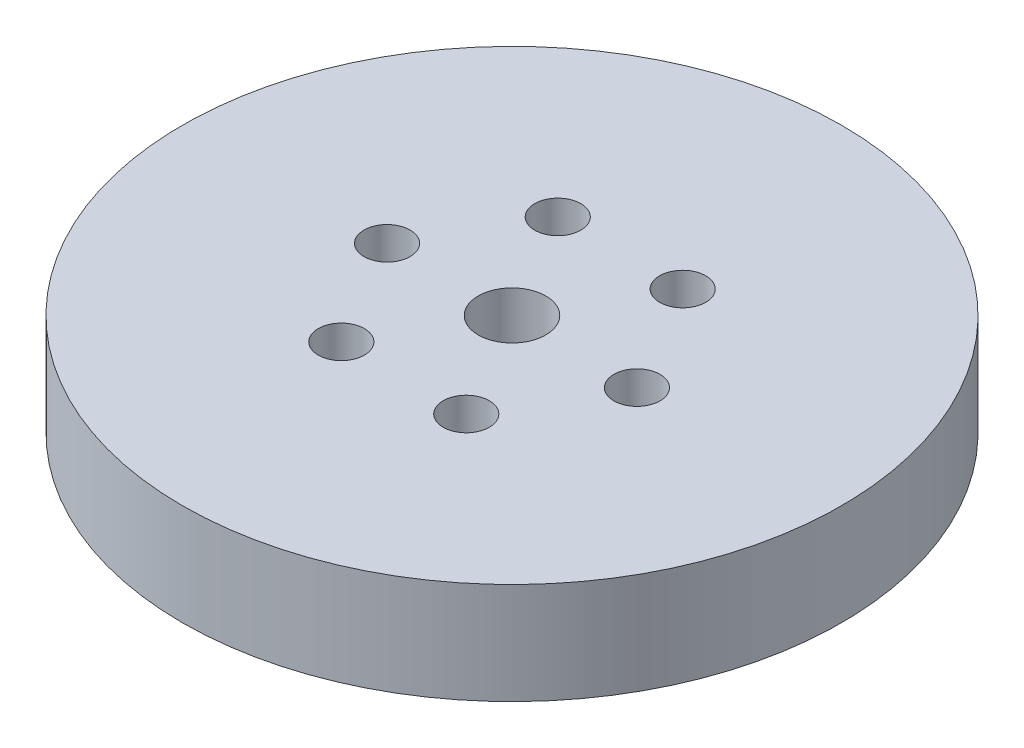
ISO-10303-21;
HEADER;
FILE_DESCRIPTION(('STEP AP214'),'2;1');
FILE_NAME('part.step','',(''),(''),'','','');
FILE_SCHEMA(('AUTOMOTIVE_DESIGN { 1 0 10303 214 1 1 1 1 }'));
ENDSEC;
DATA;
#1=APPLICATION_CONTEXT('core data for automotive mechanical design processes');
#2=APPLICATION_PROTOCOL_DEFINITION('international standard','automotive_design',2000,#1);
#3=PRODUCT_CONTEXT('',#1,'mechanical');
#4=PRODUCT('Part','Part','',(#3));
#5=PRODUCT_RELATED_PRODUCT_CATEGORY('part','',(#4));
#6=PRODUCT_DEFINITION_FORMATION('','',#4);
#7=PRODUCT_DEFINITION_CONTEXT('part definition',#1,'design');
#8=PRODUCT_DEFINITION('design','',#6,#7);
#9=PRODUCT_DEFINITION_SHAPE('','',#8);
#10=(LENGTH_UNIT() NAMED_UNIT(*) SI_UNIT(.MILLI.,.METRE.));
#11=(NAMED_UNIT(*) PLANE_ANGLE_UNIT() SI_UNIT($,.RADIAN.));
#12=(NAMED_UNIT(*) SI_UNIT($,.STERADIAN.) SOLID_ANGLE_UNIT());
#13=UNCERTAINTY_MEASURE_WITH_UNIT(LENGTH_MEASURE(1.E-05),#10,'distance_accuracy_value','');
#14=(GEOMETRIC_REPRESENTATION_CONTEXT(3) GLOBAL_UNCERTAINTY_ASSIGNED_CONTEXT((#13)) GLOBAL_UNIT_ASSIGNED_CONTEXT((#10,
#11,#12)) REPRESENTATION_CONTEXT('',''));
#15=CARTESIAN_POINT('',(0.,0.,0.));
#16=DIRECTION('',(0.,0.,1.));
#17=DIRECTION('',(1.,0.,0.));
#18=AXIS2_PLACEMENT_3D('',#15,#16,#17);
#19=CARTESIAN_POINT('',(0.,30.,0.));
#20=DIRECTION('',(0.,-1.,0.));
#21=DIRECTION('',(0.,0.,-1.));
#22=AXIS2_PLACEMENT_3D('',#19,#20,#21);
#23=CYLINDRICAL_SURFACE('',#22,97.5);
#24=CARTESIAN_POINT('',(0.,30.,0.));
#25=DIRECTION('',(0.,1.,0.));
#26=DIRECTION('',(0.,0.,1.));
#27=AXIS2_PLACEMENT_3D('',#24,#25,#26);
#28=CIRCLE('',#27,97.5);
#29=CARTESIAN_POINT('',(0.,30.,97.5));
#30=VERTEX_POINT('',#29);
#31=EDGE_CURVE('E10',#30,#30,#28,.T.);
#32=ORIENTED_EDGE('',*,*,#31,.F.);
#33=EDGE_LOOP('',(#32));
#34=FACE_BOUND('',#33,.T.);
#35=CARTESIAN_POINT('',(0.,0.,0.));
#36=DIRECTION('',(0.,1.,0.));
#37=DIRECTION('',(0.,0.,1.));
#38=AXIS2_PLACEMENT_3D('',#35,#36,#37);
#39=CIRCLE('',#38,97.5);
#40=CARTESIAN_POINT('',(0.,0.,97.5));
#41=VERTEX_POINT('',#40);
#42=EDGE_CURVE('E37',#41,#41,#39,.T.);
#43=ORIENTED_EDGE('',*,*,#42,.T.);
#44=EDGE_LOOP('',(#43));
#45=FACE_BOUND('',#44,.T.);
#46=ADVANCED_FACE('F40',(#34,#45),#23,.T.);
#47=CARTESIAN_POINT('',(0.,30.,0.));
#48=DIRECTION('',(0.,1.,0.));
#49=DIRECTION('',(0.,0.,1.));
#50=AXIS2_PLACEMENT_3D('',#47,#48,#49);
#51=PLANE('',#50);
#52=CARTESIAN_POINT('',(-18.4839377633088,30.,-32.0151193299911));
#53=DIRECTION('',(0.,1.,0.));
#54=DIRECTION('',(-0.866025403784433,0.,0.50000000000001));
#55=AXIS2_PLACEMENT_3D('',#52,#53,#54);
#56=CIRCLE('',#55,6.8190961265061);
#57=CARTESIAN_POINT('',(-24.3894482397112,30.,-28.605571266738));
#58=VERTEX_POINT('',#57);
#59=EDGE_CURVE('E70',#58,#58,#56,.T.);
#60=ORIENTED_EDGE('',*,*,#59,.F.);
#61=EDGE_LOOP('',(#60));
#62=FACE_BOUND('',#61,.T.);
#63=CARTESIAN_POINT('',(18.4839377633082,30.,-32.0151193299915));
#64=DIRECTION('',(0.,1.,0.));
#65=DIRECTION('',(-0.866025403784443,0.,-0.499999999999992));
#66=AXIS2_PLACEMENT_3D('',#63,#64,#65);
#67=CIRCLE('',#66,6.8190961265061);
#68=CARTESIAN_POINT('',(12.5784272869058,30.,-35.4246673932445));
#69=VERTEX_POINT('',#68);
#70=EDGE_CURVE('E71',#69,#69,#67,.T.);
#71=ORIENTED_EDGE('',*,*,#70,.F.);
#72=EDGE_LOOP('',(#71));
#73=FACE_BOUND('',#72,.T.);
#74=CARTESIAN_POINT('',(36.9678755266169,30.,0.));
#75=DIRECTION('',(0.,1.,0.));
#76=DIRECTION('',(0.,0.,-1.));
#77=AXIS2_PLACEMENT_3D('',#74,#75,#76);
#78=CIRCLE('',#77,6.8190961265061);
#79=CARTESIAN_POINT('',(36.9678755266169,30.,-6.8190961265061));
#80=VERTEX_POINT('',#79);
#81=EDGE_CURVE('E78',#80,#80,#78,.T.);
#82=ORIENTED_EDGE('',*,*,#81,.F.);
#83=EDGE_LOOP('',(#82));
#84=FACE_BOUND('',#83,.T.);
#85=CARTESIAN_POINT('',(18.4839377633086,30.,32.0151193299912));
#86=DIRECTION('',(0.,1.,0.));
#87=DIRECTION('',(0.866025403784436,0.,-0.500000000000004));
#88=AXIS2_PLACEMENT_3D('',#85,#86,#87);
#89=CIRCLE('',#88,6.8190961265061);
#90=CARTESIAN_POINT('',(24.389448239711,30.,28.6055712667381));
#91=VERTEX_POINT('',#90);
#92=EDGE_CURVE('E84',#91,#91,#89,.T.);
#93=ORIENTED_EDGE('',*,*,#92,.F.);
#94=EDGE_LOOP('',(#93));
#95=FACE_BOUND('',#94,.T.);
#96=CARTESIAN_POINT('',(-18.4839377633084,30.,32.0151193299914));
#97=DIRECTION('',(0.,1.,0.));
#98=DIRECTION('',(0.86602540378444,0.,0.499999999999998));
#99=AXIS2_PLACEMENT_3D('',#96,#97,#98);
#100=CIRCLE('',#99,6.8190961265061);
#101=CARTESIAN_POINT('',(-12.578427286906,30.,35.4246673932444));
#102=VERTEX_POINT('',#101);
#103=EDGE_CURVE('E61',#102,#102,#100,.T.);
#104=ORIENTED_EDGE('',*,*,#103,.F.);
#105=EDGE_LOOP('',(#104));
#106=FACE_BOUND('',#105,.T.);
#107=CARTESIAN_POINT('',(-36.9678755266169,30.,0.));
#108=DIRECTION('',(0.,1.,0.));
#109=DIRECTION('',(0.,0.,1.));
#110=AXIS2_PLACEMENT_3D('',#107,#108,#109);
#111=CIRCLE('',#110,6.8190961265061);
#112=CARTESIAN_POINT('',(-36.9678755266169,30.,6.8190961265061));
#113=VERTEX_POINT('',#112);
#114=EDGE_CURVE('E54',#113,#113,#111,.T.);
#115=ORIENTED_EDGE('',*,*,#114,.F.);
#116=EDGE_LOOP('',(#115));
#117=FACE_BOUND('',#116,.T.);
#118=CARTESIAN_POINT('',(0.,30.,0.));
#119=DIRECTION('',(0.,1.,0.));
#120=DIRECTION('',(0.,0.,1.));
#121=AXIS2_PLACEMENT_3D('',#118,#119,#120);
#122=CIRCLE('',#121,10.);
#123=CARTESIAN_POINT('',(0.,30.,10.));
#124=VERTEX_POINT('',#123);
#125=EDGE_CURVE('E50',#124,#124,#122,.T.);
#126=ORIENTED_EDGE('',*,*,#125,.F.);
#127=EDGE_LOOP('',(#126));
#128=FACE_BOUND('',#127,.T.);
#129=ORIENTED_EDGE('',*,*,#31,.T.);
#130=EDGE_LOOP('',(#129));
#131=FACE_BOUND('',#130,.T.);
#132=ADVANCED_FACE('F99',(#62,#73,#84,#95,#106,#117,#128,#131),#51,.T.);
#133=CARTESIAN_POINT('',(0.,0.,0.));
#134=DIRECTION('',(0.,1.,0.));
#135=DIRECTION('',(0.,0.,1.));
#136=AXIS2_PLACEMENT_3D('',#133,#134,#135);
#137=PLANE('',#136);
#138=CARTESIAN_POINT('',(0.,0.,0.));
#139=DIRECTION('',(0.,1.,0.));
#140=DIRECTION('',(0.,0.,1.));
#141=AXIS2_PLACEMENT_3D('',#138,#139,#140);
#142=CIRCLE('',#141,10.);
#143=CARTESIAN_POINT('',(0.,0.,10.));
#144=VERTEX_POINT('',#143);
#145=EDGE_CURVE('E47',#144,#144,#142,.T.);
#146=ORIENTED_EDGE('',*,*,#145,.T.);
#147=EDGE_LOOP('',(#146));
#148=FACE_BOUND('',#147,.T.);
#149=ORIENTED_EDGE('',*,*,#42,.F.);
#150=EDGE_LOOP('',(#149));
#151=FACE_BOUND('',#150,.T.);
#152=ADVANCED_FACE('F103',(#148,#151),#137,.F.);
#153=CARTESIAN_POINT('',(0.,30.,0.));
#154=DIRECTION('',(0.,-1.,0.));
#155=DIRECTION('',(0.,0.,-1.));
#156=AXIS2_PLACEMENT_3D('',#153,#154,#155);
#157=CYLINDRICAL_SURFACE('',#156,10.);
#158=ORIENTED_EDGE('',*,*,#125,.T.);
#159=EDGE_LOOP('',(#158));
#160=FACE_BOUND('',#159,.T.);
#161=ORIENTED_EDGE('',*,*,#145,.F.);
#162=EDGE_LOOP('',(#161));
#163=FACE_BOUND('',#162,.T.);
#164=ADVANCED_FACE('F115',(#160,#163),#157,.F.);
#165=CARTESIAN_POINT('',(-36.9678755266169,9.85878914722053,0.));
#166=DIRECTION('',(0.,1.,0.));
#167=DIRECTION('',(0.,0.,1.));
#168=AXIS2_PLACEMENT_3D('',#165,#166,#167);
#169=CYLINDRICAL_SURFACE('',#168,6.8190961265061);
#170=CARTESIAN_POINT('',(-36.9678755266169,9.85878914722053,0.));
#171=DIRECTION('',(0.,1.,0.));
#172=DIRECTION('',(0.,0.,1.));
#173=AXIS2_PLACEMENT_3D('',#170,#171,#172);
#174=CIRCLE('',#173,6.8190961265061);
#175=CARTESIAN_POINT('',(-36.9678755266169,9.85878914722053,6.8190961265061));
#176=VERTEX_POINT('',#175);
#177=EDGE_CURVE('E55',#176,#176,#174,.T.);
#178=ORIENTED_EDGE('',*,*,#177,.F.);
#179=EDGE_LOOP('',(#178));
#180=FACE_BOUND('',#179,.T.);
#181=ORIENTED_EDGE('',*,*,#114,.T.);
#182=EDGE_LOOP('',(#181));
#183=FACE_BOUND('',#182,.T.);
#184=ADVANCED_FACE('F113',(#180,#183),#169,.F.);
#185=CARTESIAN_POINT('',(-36.9678755266169,9.85878914722053,0.));
#186=DIRECTION('',(0.,1.,0.));
#187=DIRECTION('',(0.,0.,1.));
#188=AXIS2_PLACEMENT_3D('',#185,#186,#187);
#189=PLANE('',#188);
#190=ORIENTED_EDGE('',*,*,#177,.T.);
#191=EDGE_LOOP('',(#190));
#192=FACE_BOUND('',#191,.T.);
#193=ADVANCED_FACE('F144',(#192),#189,.T.);
#194=CARTESIAN_POINT('',(-18.4839377633084,9.85878914722053,32.0151193299914));
#195=DIRECTION('',(0.,1.,0.));
#196=DIRECTION('',(0.,0.,1.));
#197=AXIS2_PLACEMENT_3D('',#194,#195,#196);
#198=CYLINDRICAL_SURFACE('',#197,6.8190961265061);
#199=CARTESIAN_POINT('',(-18.4839377633084,9.85878914722053,32.0151193299914));
#200=DIRECTION('',(0.,1.,0.));
#201=DIRECTION('',(0.86602540378444,0.,0.499999999999998));
#202=AXIS2_PLACEMENT_3D('',#199,#200,#201);
#203=CIRCLE('',#202,6.8190961265061);
#204=CARTESIAN_POINT('',(-12.578427286906,9.85878914722053,35.4246673932444));
#205=VERTEX_POINT('',#204);
#206=EDGE_CURVE('E59',#205,#205,#203,.T.);
#207=ORIENTED_EDGE('',*,*,#206,.F.);
#208=EDGE_LOOP('',(#207));
#209=FACE_BOUND('',#208,.T.);
#210=ORIENTED_EDGE('',*,*,#103,.T.);
#211=EDGE_LOOP('',(#210));
#212=FACE_BOUND('',#211,.T.);
#213=ADVANCED_FACE('F153',(#209,#212),#198,.F.);
#214=CARTESIAN_POINT('',(-18.4839377633084,9.85878914722053,32.0151193299914));
#215=DIRECTION('',(0.,1.,0.));
#216=DIRECTION('',(0.86602540378444,0.,0.499999999999998));
#217=AXIS2_PLACEMENT_3D('',#214,#215,#216);
#218=PLANE('',#217);
#219=ORIENTED_EDGE('',*,*,#206,.T.);
#220=EDGE_LOOP('',(#219));
#221=FACE_BOUND('',#220,.T.);
#222=ADVANCED_FACE('F96',(#221),#218,.T.);
#223=CARTESIAN_POINT('',(18.4839377633086,9.85878914722053,32.0151193299912));
#224=DIRECTION('',(0.,1.,0.));
#225=DIRECTION('',(0.,0.,1.));
#226=AXIS2_PLACEMENT_3D('',#223,#224,#225);
#227=CYLINDRICAL_SURFACE('',#226,6.8190961265061);
#228=CARTESIAN_POINT('',(18.4839377633086,9.85878914722053,32.0151193299912));
#229=DIRECTION('',(0.,1.,0.));
#230=DIRECTION('',(0.866025403784436,0.,-0.500000000000004));
#231=AXIS2_PLACEMENT_3D('',#228,#229,#230);
#232=CIRCLE('',#231,6.8190961265061);
#233=CARTESIAN_POINT('',(24.389448239711,9.85878914722053,28.6055712667381));
#234=VERTEX_POINT('',#233);
#235=EDGE_CURVE('E63',#234,#234,#232,.T.);
#236=ORIENTED_EDGE('',*,*,#235,.F.);
#237=EDGE_LOOP('',(#236));
#238=FACE_BOUND('',#237,.T.);
#239=ORIENTED_EDGE('',*,*,#92,.T.);
#240=EDGE_LOOP('',(#239));
#241=FACE_BOUND('',#240,.T.);
#242=ADVANCED_FACE('F91',(#238,#241),#227,.F.);
#243=CARTESIAN_POINT('',(18.4839377633086,9.85878914722053,32.0151193299912));
#244=DIRECTION('',(0.,1.,0.));
#245=DIRECTION('',(0.866025403784436,0.,-0.500000000000004));
#246=AXIS2_PLACEMENT_3D('',#243,#244,#245);
#247=PLANE('',#246);
#248=ORIENTED_EDGE('',*,*,#235,.T.);
#249=EDGE_LOOP('',(#248));
#250=FACE_BOUND('',#249,.T.);
#251=ADVANCED_FACE('F93',(#250),#247,.T.);
#252=CARTESIAN_POINT('',(36.9678755266169,9.85878914722053,0.));
#253=DIRECTION('',(0.,1.,0.));
#254=DIRECTION('',(0.,0.,1.));
#255=AXIS2_PLACEMENT_3D('',#252,#253,#254);
#256=CYLINDRICAL_SURFACE('',#255,6.8190961265061);
#257=CARTESIAN_POINT('',(36.9678755266169,9.85878914722053,0.));
#258=DIRECTION('',(0.,1.,0.));
#259=DIRECTION('',(0.,0.,-1.));
#260=AXIS2_PLACEMENT_3D('',#257,#258,#259);
#261=CIRCLE('',#260,6.8190961265061);
#262=CARTESIAN_POINT('',(36.9678755266169,9.85878914722053,-6.8190961265061));
#263=VERTEX_POINT('',#262);
#264=EDGE_CURVE('E85',#263,#263,#261,.T.);
#265=ORIENTED_EDGE('',*,*,#264,.F.);
#266=EDGE_LOOP('',(#265));
#267=FACE_BOUND('',#266,.T.);
#268=ORIENTED_EDGE('',*,*,#81,.T.);
#269=EDGE_LOOP('',(#268));
#270=FACE_BOUND('',#269,.T.);
#271=ADVANCED_FACE('F187',(#267,#270),#256,.F.);
#272=CARTESIAN_POINT('',(36.9678755266169,9.85878914722053,0.));
#273=DIRECTION('',(0.,1.,0.));
#274=DIRECTION('',(0.,0.,-1.));
#275=AXIS2_PLACEMENT_3D('',#272,#273,#274);
#276=PLANE('',#275);
#277=ORIENTED_EDGE('',*,*,#264,.T.);
#278=EDGE_LOOP('',(#277));
#279=FACE_BOUND('',#278,.T.);
#280=ADVANCED_FACE('F198',(#279),#276,.T.);
#281=CARTESIAN_POINT('',(18.4839377633082,9.85878914722053,-32.0151193299915));
#282=DIRECTION('',(0.,1.,0.));
#283=DIRECTION('',(0.,0.,1.));
#284=AXIS2_PLACEMENT_3D('',#281,#282,#283);
#285=CYLINDRICAL_SURFACE('',#284,6.8190961265061);
#286=CARTESIAN_POINT('',(18.4839377633082,9.85878914722053,-32.0151193299915));
#287=DIRECTION('',(0.,1.,0.));
#288=DIRECTION('',(-0.866025403784443,0.,-0.499999999999992));
#289=AXIS2_PLACEMENT_3D('',#286,#287,#288);
#290=CIRCLE('',#289,6.8190961265061);
#291=CARTESIAN_POINT('',(12.5784272869058,9.85878914722053,-35.4246673932445));
#292=VERTEX_POINT('',#291);
#293=EDGE_CURVE('E76',#292,#292,#290,.T.);
#294=ORIENTED_EDGE('',*,*,#293,.F.);
#295=EDGE_LOOP('',(#294));
#296=FACE_BOUND('',#295,.T.);
#297=ORIENTED_EDGE('',*,*,#70,.T.);
#298=EDGE_LOOP('',(#297));
#299=FACE_BOUND('',#298,.T.);
#300=ADVANCED_FACE('F202',(#296,#299),#285,.F.);
#301=CARTESIAN_POINT('',(18.4839377633082,9.85878914722053,-32.0151193299915));
#302=DIRECTION('',(0.,1.,0.));
#303=DIRECTION('',(-0.866025403784443,0.,-0.499999999999992));
#304=AXIS2_PLACEMENT_3D('',#301,#302,#303);
#305=PLANE('',#304);
#306=ORIENTED_EDGE('',*,*,#293,.T.);
#307=EDGE_LOOP('',(#306));
#308=FACE_BOUND('',#307,.T.);
#309=ADVANCED_FACE('F212',(#308),#305,.T.);
#310=CARTESIAN_POINT('',(-18.4839377633088,9.85878914722053,-32.0151193299911));
#311=DIRECTION('',(0.,1.,0.));
#312=DIRECTION('',(0.,0.,1.));
#313=AXIS2_PLACEMENT_3D('',#310,#311,#312);
#314=CYLINDRICAL_SURFACE('',#313,6.8190961265061);
#315=CARTESIAN_POINT('',(-18.4839377633088,9.85878914722053,-32.0151193299911));
#316=DIRECTION('',(0.,1.,0.));
#317=DIRECTION('',(-0.866025403784433,0.,0.50000000000001));
#318=AXIS2_PLACEMENT_3D('',#315,#316,#317);
#319=CIRCLE('',#318,6.8190961265061);
#320=CARTESIAN_POINT('',(-24.3894482397112,9.85878914722053,-28.605571266738));
#321=VERTEX_POINT('',#320);
#322=EDGE_CURVE('E69',#321,#321,#319,.T.);
#323=ORIENTED_EDGE('',*,*,#322,.F.);
#324=EDGE_LOOP('',(#323));
#325=FACE_BOUND('',#324,.T.);
#326=ORIENTED_EDGE('',*,*,#59,.T.);
#327=EDGE_LOOP('',(#326));
#328=FACE_BOUND('',#327,.T.);
#329=ADVANCED_FACE('F224',(#325,#328),#314,.F.);
#330=CARTESIAN_POINT('',(-18.4839377633088,9.85878914722053,-32.0151193299911));
#331=DIRECTION('',(0.,1.,0.));
#332=DIRECTION('',(-0.866025403784433,0.,0.50000000000001));
#333=AXIS2_PLACEMENT_3D('',#330,#331,#332);
#334=PLANE('',#333);
#335=ORIENTED_EDGE('',*,*,#322,.T.);
#336=EDGE_LOOP('',(#335));
#337=FACE_BOUND('',#336,.T.);
#338=ADVANCED_FACE('F235',(#337),#334,.T.);
#339=CLOSED_SHELL('',(#46,#132,#152,#164,#184,#193,#213,#222,#242,#251,#271,#280,#300,#309,#329,#338));
#340=MANIFOLD_SOLID_BREP('B2',#339);
#341=ADVANCED_BREP_SHAPE_REPRESENTATION('',(#18,#340),#14);
#342=SHAPE_DEFINITION_REPRESENTATION(#9,#341);
ENDSEC;
END-ISO-10303-21;
